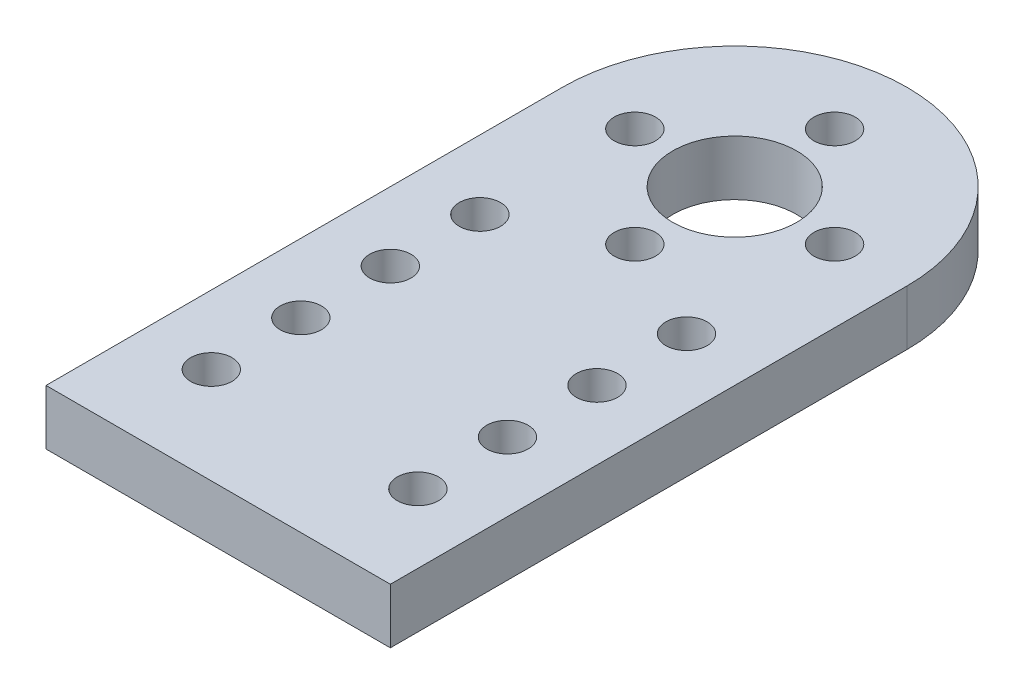
ISO-10303-21;
HEADER;
FILE_DESCRIPTION(('STEP AP214'),'2;1');
FILE_NAME('part.step','',(''),(''),'','','');
FILE_SCHEMA(('AUTOMOTIVE_DESIGN { 1 0 10303 214 1 1 1 1 }'));
ENDSEC;
DATA;
#1=APPLICATION_CONTEXT('core data for automotive mechanical design processes');
#2=APPLICATION_PROTOCOL_DEFINITION('international standard','automotive_design',2000,#1);
#3=PRODUCT_CONTEXT('',#1,'mechanical');
#4=PRODUCT('Part','Part','',(#3));
#5=PRODUCT_RELATED_PRODUCT_CATEGORY('part','',(#4));
#6=PRODUCT_DEFINITION_FORMATION('','',#4);
#7=PRODUCT_DEFINITION_CONTEXT('part definition',#1,'design');
#8=PRODUCT_DEFINITION('design','',#6,#7);
#9=PRODUCT_DEFINITION_SHAPE('','',#8);
#10=(LENGTH_UNIT() NAMED_UNIT(*) SI_UNIT(.MILLI.,.METRE.));
#11=(NAMED_UNIT(*) PLANE_ANGLE_UNIT() SI_UNIT($,.RADIAN.));
#12=(NAMED_UNIT(*) SI_UNIT($,.STERADIAN.) SOLID_ANGLE_UNIT());
#13=UNCERTAINTY_MEASURE_WITH_UNIT(LENGTH_MEASURE(1.E-05),#10,'distance_accuracy_value','');
#14=(GEOMETRIC_REPRESENTATION_CONTEXT(3) GLOBAL_UNCERTAINTY_ASSIGNED_CONTEXT((#13)) GLOBAL_UNIT_ASSIGNED_CONTEXT((#10,
#11,#12)) REPRESENTATION_CONTEXT('',''));
#15=CARTESIAN_POINT('',(0.,0.,0.));
#16=DIRECTION('',(0.,0.,1.));
#17=DIRECTION('',(1.,0.,0.));
#18=AXIS2_PLACEMENT_3D('',#15,#16,#17);
#19=CARTESIAN_POINT('',(0.,4.,-15.8522336769759));
#20=DIRECTION('',(0.,1.,0.));
#21=DIRECTION('',(0.,0.,1.));
#22=AXIS2_PLACEMENT_3D('',#19,#20,#21);
#23=PLANE('',#22);
#24=CARTESIAN_POINT('',(0.,4.,-8.60223367697593));
#25=DIRECTION('',(0.,1.,0.));
#26=DIRECTION('',(0.,0.,1.));
#27=AXIS2_PLACEMENT_3D('',#24,#25,#26);
#28=CIRCLE('',#27,1.5);
#29=CARTESIAN_POINT('',(0.,4.,-7.10223367697593));
#30=VERTEX_POINT('',#29);
#31=EDGE_CURVE('E177',#30,#30,#28,.T.);
#32=ORIENTED_EDGE('',*,*,#31,.F.);
#33=EDGE_LOOP('',(#32));
#34=FACE_BOUND('',#33,.T.);
#35=CARTESIAN_POINT('',(0.,4.,-23.1022336769759));
#36=DIRECTION('',(0.,1.,0.));
#37=DIRECTION('',(0.,0.,1.));
#38=AXIS2_PLACEMENT_3D('',#35,#36,#37);
#39=CIRCLE('',#38,1.5);
#40=CARTESIAN_POINT('',(0.,4.,-21.6022336769759));
#41=VERTEX_POINT('',#40);
#42=EDGE_CURVE('E165',#41,#41,#39,.T.);
#43=ORIENTED_EDGE('',*,*,#42,.F.);
#44=EDGE_LOOP('',(#43));
#45=FACE_BOUND('',#44,.T.);
#46=CARTESIAN_POINT('',(-7.5,4.,-4.85223367697595));
#47=DIRECTION('',(0.,1.,0.));
#48=DIRECTION('',(0.,0.,1.));
#49=AXIS2_PLACEMENT_3D('',#46,#47,#48);
#50=CIRCLE('',#49,1.5);
#51=CARTESIAN_POINT('',(-7.5,4.,-3.35223367697595));
#52=VERTEX_POINT('',#51);
#53=EDGE_CURVE('E153',#52,#52,#50,.T.);
#54=ORIENTED_EDGE('',*,*,#53,.F.);
#55=EDGE_LOOP('',(#54));
#56=FACE_BOUND('',#55,.T.);
#57=CARTESIAN_POINT('',(-7.5,4.,1.64776632302405));
#58=DIRECTION('',(0.,1.,0.));
#59=DIRECTION('',(0.,0.,1.));
#60=AXIS2_PLACEMENT_3D('',#57,#58,#59);
#61=CIRCLE('',#60,1.5);
#62=CARTESIAN_POINT('',(-7.5,4.,3.14776632302405));
#63=VERTEX_POINT('',#62);
#64=EDGE_CURVE('E141',#63,#63,#61,.T.);
#65=ORIENTED_EDGE('',*,*,#64,.F.);
#66=EDGE_LOOP('',(#65));
#67=FACE_BOUND('',#66,.T.);
#68=CARTESIAN_POINT('',(-7.5,4.,8.14776632302405));
#69=DIRECTION('',(0.,1.,0.));
#70=DIRECTION('',(0.,0.,1.));
#71=AXIS2_PLACEMENT_3D('',#68,#69,#70);
#72=CIRCLE('',#71,1.5);
#73=CARTESIAN_POINT('',(-7.5,4.,9.64776632302405));
#74=VERTEX_POINT('',#73);
#75=EDGE_CURVE('E129',#74,#74,#72,.T.);
#76=ORIENTED_EDGE('',*,*,#75,.F.);
#77=EDGE_LOOP('',(#76));
#78=FACE_BOUND('',#77,.T.);
#79=CARTESIAN_POINT('',(0.,4.,-15.8522336769759));
#80=DIRECTION('',(0.,1.,0.));
#81=DIRECTION('',(0.,0.,1.));
#82=AXIS2_PLACEMENT_3D('',#79,#80,#81);
#83=CIRCLE('',#82,4.5);
#84=CARTESIAN_POINT('',(0.,4.,-11.3522336769759));
#85=VERTEX_POINT('',#84);
#86=EDGE_CURVE('E117',#85,#85,#83,.T.);
#87=ORIENTED_EDGE('',*,*,#86,.F.);
#88=EDGE_LOOP('',(#87));
#89=FACE_BOUND('',#88,.T.);
#90=CARTESIAN_POINT('',(0.,4.,-15.8522336769759));
#91=DIRECTION('',(0.,1.,0.));
#92=DIRECTION('',(0.,0.,1.));
#93=AXIS2_PLACEMENT_3D('',#90,#91,#92);
#94=CIRCLE('',#93,12.5);
#95=CARTESIAN_POINT('',(12.5,4.,-15.8522336769759));
#96=VERTEX_POINT('',#95);
#97=CARTESIAN_POINT('',(-12.5,4.,-15.8522336769759));
#98=VERTEX_POINT('',#97);
#99=EDGE_CURVE('E87',#96,#98,#94,.T.);
#100=ORIENTED_EDGE('',*,*,#99,.T.);
#101=DIRECTION('',(0.,0.,1.));
#102=VECTOR('',#101,1.);
#103=CARTESIAN_POINT('',(-12.5,4.,-15.8522336769759));
#104=LINE('',#103,#102);
#105=CARTESIAN_POINT('',(-12.5,4.,21.6477663230241));
#106=VERTEX_POINT('',#105);
#107=EDGE_CURVE('E82',#98,#106,#104,.T.);
#108=ORIENTED_EDGE('',*,*,#107,.T.);
#109=DIRECTION('',(1.,0.,0.));
#110=VECTOR('',#109,1.);
#111=CARTESIAN_POINT('',(-12.5,4.,21.6477663230241));
#112=LINE('',#111,#110);
#113=CARTESIAN_POINT('',(12.5,4.,21.6477663230241));
#114=VERTEX_POINT('',#113);
#115=EDGE_CURVE('E85',#106,#114,#112,.T.);
#116=ORIENTED_EDGE('',*,*,#115,.T.);
#117=DIRECTION('',(0.,0.,-1.));
#118=VECTOR('',#117,1.);
#119=CARTESIAN_POINT('',(12.5,4.,21.6477663230241));
#120=LINE('',#119,#118);
#121=EDGE_CURVE('E52',#114,#96,#120,.T.);
#122=ORIENTED_EDGE('',*,*,#121,.T.);
#123=EDGE_LOOP('',(#100,#108,#116,#122));
#124=FACE_BOUND('',#123,.T.);
#125=CARTESIAN_POINT('',(-7.5,4.,14.6477663230241));
#126=DIRECTION('',(0.,1.,0.));
#127=DIRECTION('',(0.,0.,1.));
#128=AXIS2_PLACEMENT_3D('',#125,#126,#127);
#129=CIRCLE('',#128,1.5);
#130=CARTESIAN_POINT('',(-7.5,4.,16.1477663230241));
#131=VERTEX_POINT('',#130);
#132=EDGE_CURVE('E102',#131,#131,#129,.T.);
#133=ORIENTED_EDGE('',*,*,#132,.F.);
#134=EDGE_LOOP('',(#133));
#135=FACE_BOUND('',#134,.T.);
#136=CARTESIAN_POINT('',(7.5,4.,14.6477663230241));
#137=DIRECTION('',(0.,1.,0.));
#138=DIRECTION('',(0.,0.,1.));
#139=AXIS2_PLACEMENT_3D('',#136,#137,#138);
#140=CIRCLE('',#139,1.5);
#141=CARTESIAN_POINT('',(7.5,4.,16.1477663230241));
#142=VERTEX_POINT('',#141);
#143=EDGE_CURVE('E123',#142,#142,#140,.T.);
#144=ORIENTED_EDGE('',*,*,#143,.F.);
#145=EDGE_LOOP('',(#144));
#146=FACE_BOUND('',#145,.T.);
#147=CARTESIAN_POINT('',(7.5,4.,8.14776632302406));
#148=DIRECTION('',(0.,1.,0.));
#149=DIRECTION('',(0.,0.,1.));
#150=AXIS2_PLACEMENT_3D('',#147,#148,#149);
#151=CIRCLE('',#150,1.5);
#152=CARTESIAN_POINT('',(7.5,4.,9.64776632302406));
#153=VERTEX_POINT('',#152);
#154=EDGE_CURVE('E135',#153,#153,#151,.T.);
#155=ORIENTED_EDGE('',*,*,#154,.F.);
#156=EDGE_LOOP('',(#155));
#157=FACE_BOUND('',#156,.T.);
#158=CARTESIAN_POINT('',(7.5,4.,1.64776632302405));
#159=DIRECTION('',(0.,1.,0.));
#160=DIRECTION('',(0.,0.,1.));
#161=AXIS2_PLACEMENT_3D('',#158,#159,#160);
#162=CIRCLE('',#161,1.5);
#163=CARTESIAN_POINT('',(7.5,4.,3.14776632302405));
#164=VERTEX_POINT('',#163);
#165=EDGE_CURVE('E147',#164,#164,#162,.T.);
#166=ORIENTED_EDGE('',*,*,#165,.F.);
#167=EDGE_LOOP('',(#166));
#168=FACE_BOUND('',#167,.T.);
#169=CARTESIAN_POINT('',(7.5,4.,-4.85223367697595));
#170=DIRECTION('',(0.,1.,0.));
#171=DIRECTION('',(0.,0.,1.));
#172=AXIS2_PLACEMENT_3D('',#169,#170,#171);
#173=CIRCLE('',#172,1.5);
#174=CARTESIAN_POINT('',(7.5,4.,-3.35223367697595));
#175=VERTEX_POINT('',#174);
#176=EDGE_CURVE('E159',#175,#175,#173,.T.);
#177=ORIENTED_EDGE('',*,*,#176,.F.);
#178=EDGE_LOOP('',(#177));
#179=FACE_BOUND('',#178,.T.);
#180=CARTESIAN_POINT('',(7.25,4.,-15.8522336769759));
#181=DIRECTION('',(0.,1.,0.));
#182=DIRECTION('',(0.,0.,1.));
#183=AXIS2_PLACEMENT_3D('',#180,#181,#182);
#184=CIRCLE('',#183,1.5);
#185=CARTESIAN_POINT('',(7.25,4.,-14.3522336769759));
#186=VERTEX_POINT('',#185);
#187=EDGE_CURVE('E171',#186,#186,#184,.T.);
#188=ORIENTED_EDGE('',*,*,#187,.F.);
#189=EDGE_LOOP('',(#188));
#190=FACE_BOUND('',#189,.T.);
#191=CARTESIAN_POINT('',(-7.25,4.,-15.8522336769759));
#192=DIRECTION('',(0.,1.,0.));
#193=DIRECTION('',(0.,0.,1.));
#194=AXIS2_PLACEMENT_3D('',#191,#192,#193);
#195=CIRCLE('',#194,1.5);
#196=CARTESIAN_POINT('',(-7.25,4.,-14.3522336769759));
#197=VERTEX_POINT('',#196);
#198=EDGE_CURVE('E183',#197,#197,#195,.T.);
#199=ORIENTED_EDGE('',*,*,#198,.F.);
#200=EDGE_LOOP('',(#199));
#201=FACE_BOUND('',#200,.T.);
#202=ADVANCED_FACE('F35',(#34,#45,#56,#67,#78,#89,#124,#135,#146,#157,#168,#179,#190,#201),#23,.T.);
#203=CARTESIAN_POINT('',(0.,0.,-15.8522336769759));
#204=DIRECTION('',(0.,1.,0.));
#205=DIRECTION('',(0.,0.,1.));
#206=AXIS2_PLACEMENT_3D('',#203,#204,#205);
#207=PLANE('',#206);
#208=CARTESIAN_POINT('',(0.,0.,-15.8522336769759));
#209=DIRECTION('',(0.,1.,0.));
#210=DIRECTION('',(0.,0.,1.));
#211=AXIS2_PLACEMENT_3D('',#208,#209,#210);
#212=CIRCLE('',#211,12.5);
#213=CARTESIAN_POINT('',(12.5,0.,-15.8522336769759));
#214=VERTEX_POINT('',#213);
#215=CARTESIAN_POINT('',(-12.5,0.,-15.8522336769759));
#216=VERTEX_POINT('',#215);
#217=EDGE_CURVE('E99',#214,#216,#212,.T.);
#218=ORIENTED_EDGE('',*,*,#217,.F.);
#219=DIRECTION('',(0.,0.,-1.));
#220=VECTOR('',#219,1.);
#221=CARTESIAN_POINT('',(12.5,0.,21.6477663230241));
#222=LINE('',#221,#220);
#223=CARTESIAN_POINT('',(12.5,0.,21.6477663230241));
#224=VERTEX_POINT('',#223);
#225=EDGE_CURVE('E75',#224,#214,#222,.T.);
#226=ORIENTED_EDGE('',*,*,#225,.F.);
#227=DIRECTION('',(1.,0.,0.));
#228=VECTOR('',#227,1.);
#229=CARTESIAN_POINT('',(-12.5,0.,21.6477663230241));
#230=LINE('',#229,#228);
#231=CARTESIAN_POINT('',(-12.5,0.,21.6477663230241));
#232=VERTEX_POINT('',#231);
#233=EDGE_CURVE('E69',#232,#224,#230,.T.);
#234=ORIENTED_EDGE('',*,*,#233,.F.);
#235=DIRECTION('',(0.,0.,1.));
#236=VECTOR('',#235,1.);
#237=CARTESIAN_POINT('',(-12.5,0.,-15.8522336769759));
#238=LINE('',#237,#236);
#239=EDGE_CURVE('E91',#216,#232,#238,.T.);
#240=ORIENTED_EDGE('',*,*,#239,.F.);
#241=EDGE_LOOP('',(#218,#226,#234,#240));
#242=FACE_BOUND('',#241,.T.);
#243=CARTESIAN_POINT('',(-7.5,0.,14.6477663230241));
#244=DIRECTION('',(0.,1.,0.));
#245=DIRECTION('',(0.,0.,1.));
#246=AXIS2_PLACEMENT_3D('',#243,#244,#245);
#247=CIRCLE('',#246,1.5);
#248=CARTESIAN_POINT('',(-7.5,0.,16.1477663230241));
#249=VERTEX_POINT('',#248);
#250=EDGE_CURVE('E114',#249,#249,#247,.T.);
#251=ORIENTED_EDGE('',*,*,#250,.T.);
#252=EDGE_LOOP('',(#251));
#253=FACE_BOUND('',#252,.T.);
#254=CARTESIAN_POINT('',(0.,0.,-15.8522336769759));
#255=DIRECTION('',(0.,1.,0.));
#256=DIRECTION('',(0.,0.,1.));
#257=AXIS2_PLACEMENT_3D('',#254,#255,#256);
#258=CIRCLE('',#257,4.5);
#259=CARTESIAN_POINT('',(0.,0.,-11.3522336769759));
#260=VERTEX_POINT('',#259);
#261=EDGE_CURVE('E120',#260,#260,#258,.T.);
#262=ORIENTED_EDGE('',*,*,#261,.T.);
#263=EDGE_LOOP('',(#262));
#264=FACE_BOUND('',#263,.T.);
#265=CARTESIAN_POINT('',(7.5,0.,14.6477663230241));
#266=DIRECTION('',(0.,1.,0.));
#267=DIRECTION('',(0.,0.,1.));
#268=AXIS2_PLACEMENT_3D('',#265,#266,#267);
#269=CIRCLE('',#268,1.5);
#270=CARTESIAN_POINT('',(7.5,0.,16.1477663230241));
#271=VERTEX_POINT('',#270);
#272=EDGE_CURVE('E126',#271,#271,#269,.T.);
#273=ORIENTED_EDGE('',*,*,#272,.T.);
#274=EDGE_LOOP('',(#273));
#275=FACE_BOUND('',#274,.T.);
#276=CARTESIAN_POINT('',(-7.5,0.,8.14776632302405));
#277=DIRECTION('',(0.,1.,0.));
#278=DIRECTION('',(0.,0.,1.));
#279=AXIS2_PLACEMENT_3D('',#276,#277,#278);
#280=CIRCLE('',#279,1.5);
#281=CARTESIAN_POINT('',(-7.5,0.,9.64776632302405));
#282=VERTEX_POINT('',#281);
#283=EDGE_CURVE('E132',#282,#282,#280,.T.);
#284=ORIENTED_EDGE('',*,*,#283,.T.);
#285=EDGE_LOOP('',(#284));
#286=FACE_BOUND('',#285,.T.);
#287=CARTESIAN_POINT('',(7.5,0.,8.14776632302406));
#288=DIRECTION('',(0.,1.,0.));
#289=DIRECTION('',(0.,0.,1.));
#290=AXIS2_PLACEMENT_3D('',#287,#288,#289);
#291=CIRCLE('',#290,1.5);
#292=CARTESIAN_POINT('',(7.5,0.,9.64776632302406));
#293=VERTEX_POINT('',#292);
#294=EDGE_CURVE('E138',#293,#293,#291,.T.);
#295=ORIENTED_EDGE('',*,*,#294,.T.);
#296=EDGE_LOOP('',(#295));
#297=FACE_BOUND('',#296,.T.);
#298=CARTESIAN_POINT('',(-7.5,0.,1.64776632302405));
#299=DIRECTION('',(0.,1.,0.));
#300=DIRECTION('',(0.,0.,1.));
#301=AXIS2_PLACEMENT_3D('',#298,#299,#300);
#302=CIRCLE('',#301,1.5);
#303=CARTESIAN_POINT('',(-7.5,0.,3.14776632302405));
#304=VERTEX_POINT('',#303);
#305=EDGE_CURVE('E144',#304,#304,#302,.T.);
#306=ORIENTED_EDGE('',*,*,#305,.T.);
#307=EDGE_LOOP('',(#306));
#308=FACE_BOUND('',#307,.T.);
#309=CARTESIAN_POINT('',(7.5,0.,1.64776632302405));
#310=DIRECTION('',(0.,1.,0.));
#311=DIRECTION('',(0.,0.,1.));
#312=AXIS2_PLACEMENT_3D('',#309,#310,#311);
#313=CIRCLE('',#312,1.5);
#314=CARTESIAN_POINT('',(7.5,0.,3.14776632302405));
#315=VERTEX_POINT('',#314);
#316=EDGE_CURVE('E150',#315,#315,#313,.T.);
#317=ORIENTED_EDGE('',*,*,#316,.T.);
#318=EDGE_LOOP('',(#317));
#319=FACE_BOUND('',#318,.T.);
#320=CARTESIAN_POINT('',(-7.5,0.,-4.85223367697595));
#321=DIRECTION('',(0.,1.,0.));
#322=DIRECTION('',(0.,0.,1.));
#323=AXIS2_PLACEMENT_3D('',#320,#321,#322);
#324=CIRCLE('',#323,1.5);
#325=CARTESIAN_POINT('',(-7.5,0.,-3.35223367697595));
#326=VERTEX_POINT('',#325);
#327=EDGE_CURVE('E156',#326,#326,#324,.T.);
#328=ORIENTED_EDGE('',*,*,#327,.T.);
#329=EDGE_LOOP('',(#328));
#330=FACE_BOUND('',#329,.T.);
#331=CARTESIAN_POINT('',(7.5,0.,-4.85223367697595));
#332=DIRECTION('',(0.,1.,0.));
#333=DIRECTION('',(0.,0.,1.));
#334=AXIS2_PLACEMENT_3D('',#331,#332,#333);
#335=CIRCLE('',#334,1.5);
#336=CARTESIAN_POINT('',(7.5,0.,-3.35223367697595));
#337=VERTEX_POINT('',#336);
#338=EDGE_CURVE('E162',#337,#337,#335,.T.);
#339=ORIENTED_EDGE('',*,*,#338,.T.);
#340=EDGE_LOOP('',(#339));
#341=FACE_BOUND('',#340,.T.);
#342=CARTESIAN_POINT('',(0.,0.,-23.1022336769759));
#343=DIRECTION('',(0.,1.,0.));
#344=DIRECTION('',(0.,0.,1.));
#345=AXIS2_PLACEMENT_3D('',#342,#343,#344);
#346=CIRCLE('',#345,1.5);
#347=CARTESIAN_POINT('',(0.,0.,-21.6022336769759));
#348=VERTEX_POINT('',#347);
#349=EDGE_CURVE('E168',#348,#348,#346,.T.);
#350=ORIENTED_EDGE('',*,*,#349,.T.);
#351=EDGE_LOOP('',(#350));
#352=FACE_BOUND('',#351,.T.);
#353=CARTESIAN_POINT('',(7.25,0.,-15.8522336769759));
#354=DIRECTION('',(0.,1.,0.));
#355=DIRECTION('',(0.,0.,1.));
#356=AXIS2_PLACEMENT_3D('',#353,#354,#355);
#357=CIRCLE('',#356,1.5);
#358=CARTESIAN_POINT('',(7.25,0.,-14.3522336769759));
#359=VERTEX_POINT('',#358);
#360=EDGE_CURVE('E174',#359,#359,#357,.T.);
#361=ORIENTED_EDGE('',*,*,#360,.T.);
#362=EDGE_LOOP('',(#361));
#363=FACE_BOUND('',#362,.T.);
#364=CARTESIAN_POINT('',(0.,0.,-8.60223367697593));
#365=DIRECTION('',(0.,1.,0.));
#366=DIRECTION('',(0.,0.,1.));
#367=AXIS2_PLACEMENT_3D('',#364,#365,#366);
#368=CIRCLE('',#367,1.5);
#369=CARTESIAN_POINT('',(0.,0.,-7.10223367697593));
#370=VERTEX_POINT('',#369);
#371=EDGE_CURVE('E180',#370,#370,#368,.T.);
#372=ORIENTED_EDGE('',*,*,#371,.T.);
#373=EDGE_LOOP('',(#372));
#374=FACE_BOUND('',#373,.T.);
#375=CARTESIAN_POINT('',(-7.25,0.,-15.8522336769759));
#376=DIRECTION('',(0.,1.,0.));
#377=DIRECTION('',(0.,0.,1.));
#378=AXIS2_PLACEMENT_3D('',#375,#376,#377);
#379=CIRCLE('',#378,1.5);
#380=CARTESIAN_POINT('',(-7.25,0.,-14.3522336769759));
#381=VERTEX_POINT('',#380);
#382=EDGE_CURVE('E186',#381,#381,#379,.T.);
#383=ORIENTED_EDGE('',*,*,#382,.T.);
#384=EDGE_LOOP('',(#383));
#385=FACE_BOUND('',#384,.T.);
#386=ADVANCED_FACE('F110',(#242,#253,#264,#275,#286,#297,#308,#319,#330,#341,#352,#363,#374,
#385),#207,.F.);
#387=CARTESIAN_POINT('',(0.,4.,-15.8522336769759));
#388=DIRECTION('',(0.,-1.,0.));
#389=DIRECTION('',(0.,0.,-1.));
#390=AXIS2_PLACEMENT_3D('',#387,#388,#389);
#391=CYLINDRICAL_SURFACE('',#390,12.5);
#392=ORIENTED_EDGE('',*,*,#217,.T.);
#393=DIRECTION('',(0.,-1.,0.));
#394=VECTOR('',#393,1.);
#395=CARTESIAN_POINT('',(-12.5,4.,-15.8522336769759));
#396=LINE('',#395,#394);
#397=EDGE_CURVE('E11',#98,#216,#396,.T.);
#398=ORIENTED_EDGE('',*,*,#397,.F.);
#399=ORIENTED_EDGE('',*,*,#99,.F.);
#400=DIRECTION('',(0.,-1.,0.));
#401=VECTOR('',#400,1.);
#402=CARTESIAN_POINT('',(12.5,4.,-15.8522336769759));
#403=LINE('',#402,#401);
#404=EDGE_CURVE('E95',#96,#214,#403,.T.);
#405=ORIENTED_EDGE('',*,*,#404,.T.);
#406=EDGE_LOOP('',(#392,#398,#399,#405));
#407=FACE_BOUND('',#406,.T.);
#408=ADVANCED_FACE('F37',(#407),#391,.T.);
#409=CARTESIAN_POINT('',(-12.5,4.,-15.8522336769759));
#410=DIRECTION('',(1.,0.,0.));
#411=DIRECTION('',(0.,0.,-1.));
#412=AXIS2_PLACEMENT_3D('',#409,#410,#411);
#413=PLANE('',#412);
#414=ORIENTED_EDGE('',*,*,#239,.T.);
#415=DIRECTION('',(0.,-1.,0.));
#416=VECTOR('',#415,1.);
#417=CARTESIAN_POINT('',(-12.5,4.,21.6477663230241));
#418=LINE('',#417,#416);
#419=EDGE_CURVE('E44',#106,#232,#418,.T.);
#420=ORIENTED_EDGE('',*,*,#419,.F.);
#421=ORIENTED_EDGE('',*,*,#107,.F.);
#422=ORIENTED_EDGE('',*,*,#397,.T.);
#423=EDGE_LOOP('',(#414,#420,#421,#422));
#424=FACE_BOUND('',#423,.T.);
#425=ADVANCED_FACE('F90',(#424),#413,.F.);
#426=CARTESIAN_POINT('',(-12.5,4.,21.6477663230241));
#427=DIRECTION('',(0.,0.,-1.));
#428=DIRECTION('',(-1.,0.,0.));
#429=AXIS2_PLACEMENT_3D('',#426,#427,#428);
#430=PLANE('',#429);
#431=ORIENTED_EDGE('',*,*,#233,.T.);
#432=DIRECTION('',(0.,-1.,0.));
#433=VECTOR('',#432,1.);
#434=CARTESIAN_POINT('',(12.5,4.,21.6477663230241));
#435=LINE('',#434,#433);
#436=EDGE_CURVE('E92',#114,#224,#435,.T.);
#437=ORIENTED_EDGE('',*,*,#436,.F.);
#438=ORIENTED_EDGE('',*,*,#115,.F.);
#439=ORIENTED_EDGE('',*,*,#419,.T.);
#440=EDGE_LOOP('',(#431,#437,#438,#439));
#441=FACE_BOUND('',#440,.T.);
#442=ADVANCED_FACE('F93',(#441),#430,.F.);
#443=CARTESIAN_POINT('',(12.5,4.,21.6477663230241));
#444=DIRECTION('',(-1.,0.,0.));
#445=DIRECTION('',(0.,0.,1.));
#446=AXIS2_PLACEMENT_3D('',#443,#444,#445);
#447=PLANE('',#446);
#448=ORIENTED_EDGE('',*,*,#225,.T.);
#449=ORIENTED_EDGE('',*,*,#404,.F.);
#450=ORIENTED_EDGE('',*,*,#121,.F.);
#451=ORIENTED_EDGE('',*,*,#436,.T.);
#452=EDGE_LOOP('',(#448,#449,#450,#451));
#453=FACE_BOUND('',#452,.T.);
#454=ADVANCED_FACE('F107',(#453),#447,.F.);
#455=CARTESIAN_POINT('',(-7.5,4.,14.6477663230241));
#456=DIRECTION('',(0.,-1.,0.));
#457=DIRECTION('',(0.,0.,-1.));
#458=AXIS2_PLACEMENT_3D('',#455,#456,#457);
#459=CYLINDRICAL_SURFACE('',#458,1.5);
#460=ORIENTED_EDGE('',*,*,#132,.T.);
#461=EDGE_LOOP('',(#460));
#462=FACE_BOUND('',#461,.T.);
#463=ORIENTED_EDGE('',*,*,#250,.F.);
#464=EDGE_LOOP('',(#463));
#465=FACE_BOUND('',#464,.T.);
#466=ADVANCED_FACE('F205',(#462,#465),#459,.F.);
#467=CARTESIAN_POINT('',(0.,4.,-15.8522336769759));
#468=DIRECTION('',(0.,-1.,0.));
#469=DIRECTION('',(0.,0.,-1.));
#470=AXIS2_PLACEMENT_3D('',#467,#468,#469);
#471=CYLINDRICAL_SURFACE('',#470,4.5);
#472=ORIENTED_EDGE('',*,*,#86,.T.);
#473=EDGE_LOOP('',(#472));
#474=FACE_BOUND('',#473,.T.);
#475=ORIENTED_EDGE('',*,*,#261,.F.);
#476=EDGE_LOOP('',(#475));
#477=FACE_BOUND('',#476,.T.);
#478=ADVANCED_FACE('F251',(#474,#477),#471,.F.);
#479=CARTESIAN_POINT('',(7.5,4.,14.6477663230241));
#480=DIRECTION('',(0.,-1.,0.));
#481=DIRECTION('',(0.,0.,-1.));
#482=AXIS2_PLACEMENT_3D('',#479,#480,#481);
#483=CYLINDRICAL_SURFACE('',#482,1.5);
#484=ORIENTED_EDGE('',*,*,#143,.T.);
#485=EDGE_LOOP('',(#484));
#486=FACE_BOUND('',#485,.T.);
#487=ORIENTED_EDGE('',*,*,#272,.F.);
#488=EDGE_LOOP('',(#487));
#489=FACE_BOUND('',#488,.T.);
#490=ADVANCED_FACE('F259',(#486,#489),#483,.F.);
#491=CARTESIAN_POINT('',(-7.5,4.,8.14776632302405));
#492=DIRECTION('',(0.,-1.,0.));
#493=DIRECTION('',(0.,0.,-1.));
#494=AXIS2_PLACEMENT_3D('',#491,#492,#493);
#495=CYLINDRICAL_SURFACE('',#494,1.5);
#496=ORIENTED_EDGE('',*,*,#75,.T.);
#497=EDGE_LOOP('',(#496));
#498=FACE_BOUND('',#497,.T.);
#499=ORIENTED_EDGE('',*,*,#283,.F.);
#500=EDGE_LOOP('',(#499));
#501=FACE_BOUND('',#500,.T.);
#502=ADVANCED_FACE('F267',(#498,#501),#495,.F.);
#503=CARTESIAN_POINT('',(7.5,4.,8.14776632302406));
#504=DIRECTION('',(0.,-1.,0.));
#505=DIRECTION('',(0.,0.,-1.));
#506=AXIS2_PLACEMENT_3D('',#503,#504,#505);
#507=CYLINDRICAL_SURFACE('',#506,1.5);
#508=ORIENTED_EDGE('',*,*,#154,.T.);
#509=EDGE_LOOP('',(#508));
#510=FACE_BOUND('',#509,.T.);
#511=ORIENTED_EDGE('',*,*,#294,.F.);
#512=EDGE_LOOP('',(#511));
#513=FACE_BOUND('',#512,.T.);
#514=ADVANCED_FACE('F276',(#510,#513),#507,.F.);
#515=CARTESIAN_POINT('',(-7.5,4.,1.64776632302405));
#516=DIRECTION('',(0.,-1.,0.));
#517=DIRECTION('',(0.,0.,-1.));
#518=AXIS2_PLACEMENT_3D('',#515,#516,#517);
#519=CYLINDRICAL_SURFACE('',#518,1.5);
#520=ORIENTED_EDGE('',*,*,#64,.T.);
#521=EDGE_LOOP('',(#520));
#522=FACE_BOUND('',#521,.T.);
#523=ORIENTED_EDGE('',*,*,#305,.F.);
#524=EDGE_LOOP('',(#523));
#525=FACE_BOUND('',#524,.T.);
#526=ADVANCED_FACE('F285',(#522,#525),#519,.F.);
#527=CARTESIAN_POINT('',(7.5,4.,1.64776632302405));
#528=DIRECTION('',(0.,-1.,0.));
#529=DIRECTION('',(0.,0.,-1.));
#530=AXIS2_PLACEMENT_3D('',#527,#528,#529);
#531=CYLINDRICAL_SURFACE('',#530,1.5);
#532=ORIENTED_EDGE('',*,*,#165,.T.);
#533=EDGE_LOOP('',(#532));
#534=FACE_BOUND('',#533,.T.);
#535=ORIENTED_EDGE('',*,*,#316,.F.);
#536=EDGE_LOOP('',(#535));
#537=FACE_BOUND('',#536,.T.);
#538=ADVANCED_FACE('F294',(#534,#537),#531,.F.);
#539=CARTESIAN_POINT('',(-7.5,4.,-4.85223367697595));
#540=DIRECTION('',(0.,-1.,0.));
#541=DIRECTION('',(0.,0.,-1.));
#542=AXIS2_PLACEMENT_3D('',#539,#540,#541);
#543=CYLINDRICAL_SURFACE('',#542,1.5);
#544=ORIENTED_EDGE('',*,*,#53,.T.);
#545=EDGE_LOOP('',(#544));
#546=FACE_BOUND('',#545,.T.);
#547=ORIENTED_EDGE('',*,*,#327,.F.);
#548=EDGE_LOOP('',(#547));
#549=FACE_BOUND('',#548,.T.);
#550=ADVANCED_FACE('F303',(#546,#549),#543,.F.);
#551=CARTESIAN_POINT('',(7.5,4.,-4.85223367697595));
#552=DIRECTION('',(0.,-1.,0.));
#553=DIRECTION('',(0.,0.,-1.));
#554=AXIS2_PLACEMENT_3D('',#551,#552,#553);
#555=CYLINDRICAL_SURFACE('',#554,1.5);
#556=ORIENTED_EDGE('',*,*,#176,.T.);
#557=EDGE_LOOP('',(#556));
#558=FACE_BOUND('',#557,.T.);
#559=ORIENTED_EDGE('',*,*,#338,.F.);
#560=EDGE_LOOP('',(#559));
#561=FACE_BOUND('',#560,.T.);
#562=ADVANCED_FACE('F312',(#558,#561),#555,.F.);
#563=CARTESIAN_POINT('',(0.,4.,-23.1022336769759));
#564=DIRECTION('',(0.,-1.,0.));
#565=DIRECTION('',(0.,0.,-1.));
#566=AXIS2_PLACEMENT_3D('',#563,#564,#565);
#567=CYLINDRICAL_SURFACE('',#566,1.5);
#568=ORIENTED_EDGE('',*,*,#42,.T.);
#569=EDGE_LOOP('',(#568));
#570=FACE_BOUND('',#569,.T.);
#571=ORIENTED_EDGE('',*,*,#349,.F.);
#572=EDGE_LOOP('',(#571));
#573=FACE_BOUND('',#572,.T.);
#574=ADVANCED_FACE('F321',(#570,#573),#567,.F.);
#575=CARTESIAN_POINT('',(7.25,4.,-15.8522336769759));
#576=DIRECTION('',(0.,-1.,0.));
#577=DIRECTION('',(0.,0.,-1.));
#578=AXIS2_PLACEMENT_3D('',#575,#576,#577);
#579=CYLINDRICAL_SURFACE('',#578,1.5);
#580=ORIENTED_EDGE('',*,*,#187,.T.);
#581=EDGE_LOOP('',(#580));
#582=FACE_BOUND('',#581,.T.);
#583=ORIENTED_EDGE('',*,*,#360,.F.);
#584=EDGE_LOOP('',(#583));
#585=FACE_BOUND('',#584,.T.);
#586=ADVANCED_FACE('F330',(#582,#585),#579,.F.);
#587=CARTESIAN_POINT('',(0.,4.,-8.60223367697593));
#588=DIRECTION('',(0.,-1.,0.));
#589=DIRECTION('',(0.,0.,-1.));
#590=AXIS2_PLACEMENT_3D('',#587,#588,#589);
#591=CYLINDRICAL_SURFACE('',#590,1.5);
#592=ORIENTED_EDGE('',*,*,#31,.T.);
#593=EDGE_LOOP('',(#592));
#594=FACE_BOUND('',#593,.T.);
#595=ORIENTED_EDGE('',*,*,#371,.F.);
#596=EDGE_LOOP('',(#595));
#597=FACE_BOUND('',#596,.T.);
#598=ADVANCED_FACE('F339',(#594,#597),#591,.F.);
#599=CARTESIAN_POINT('',(-7.25,4.,-15.8522336769759));
#600=DIRECTION('',(0.,-1.,0.));
#601=DIRECTION('',(0.,0.,-1.));
#602=AXIS2_PLACEMENT_3D('',#599,#600,#601);
#603=CYLINDRICAL_SURFACE('',#602,1.5);
#604=ORIENTED_EDGE('',*,*,#198,.T.);
#605=EDGE_LOOP('',(#604));
#606=FACE_BOUND('',#605,.T.);
#607=ORIENTED_EDGE('',*,*,#382,.F.);
#608=EDGE_LOOP('',(#607));
#609=FACE_BOUND('',#608,.T.);
#610=ADVANCED_FACE('F192',(#606,#609),#603,.F.);
#611=CLOSED_SHELL('',(#202,#386,#408,#425,#442,#454,#466,#478,#490,#502,#514,#526,#538,#550,
#562,#574,#586,#598,#610));
#612=MANIFOLD_SOLID_BREP('B2',#611);
#613=ADVANCED_BREP_SHAPE_REPRESENTATION('',(#18,#612),#14);
#614=SHAPE_DEFINITION_REPRESENTATION(#9,#613);
ENDSEC;
END-ISO-10303-21;
